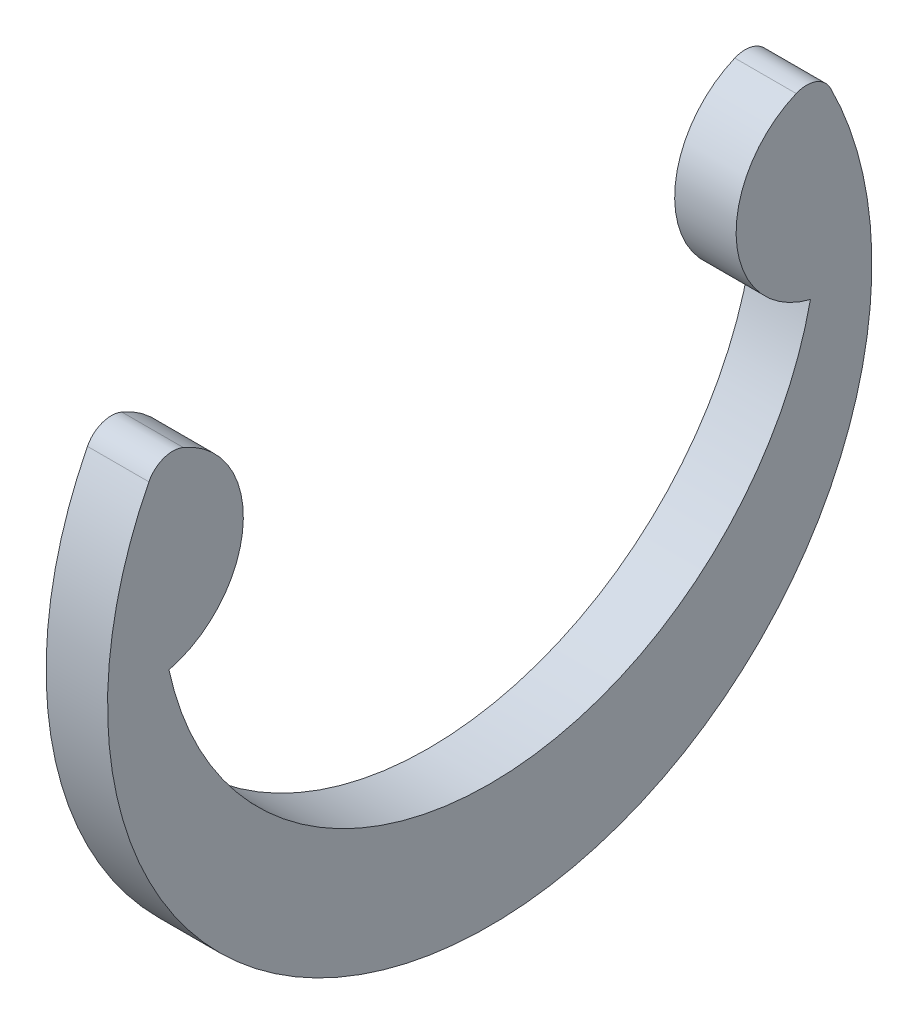
ISO-10303-21;
HEADER;
FILE_DESCRIPTION(('STEP AP214'),'2;1');
FILE_NAME('part.step','',(''),(''),'','','');
FILE_SCHEMA(('AUTOMOTIVE_DESIGN { 1 0 10303 214 1 1 1 1 }'));
ENDSEC;
DATA;
#1=APPLICATION_CONTEXT('core data for automotive mechanical design processes');
#2=APPLICATION_PROTOCOL_DEFINITION('international standard','automotive_design',2000,#1);
#3=PRODUCT_CONTEXT('',#1,'mechanical');
#4=PRODUCT('Part','Part','',(#3));
#5=PRODUCT_RELATED_PRODUCT_CATEGORY('part','',(#4));
#6=PRODUCT_DEFINITION_FORMATION('','',#4);
#7=PRODUCT_DEFINITION_CONTEXT('part definition',#1,'design');
#8=PRODUCT_DEFINITION('design','',#6,#7);
#9=PRODUCT_DEFINITION_SHAPE('','',#8);
#10=(LENGTH_UNIT() NAMED_UNIT(*) SI_UNIT(.MILLI.,.METRE.));
#11=(NAMED_UNIT(*) PLANE_ANGLE_UNIT() SI_UNIT($,.RADIAN.));
#12=(NAMED_UNIT(*) SI_UNIT($,.STERADIAN.) SOLID_ANGLE_UNIT());
#13=UNCERTAINTY_MEASURE_WITH_UNIT(LENGTH_MEASURE(1.E-05),#10,'distance_accuracy_value','');
#14=(GEOMETRIC_REPRESENTATION_CONTEXT(3) GLOBAL_UNCERTAINTY_ASSIGNED_CONTEXT((#13)) GLOBAL_UNIT_ASSIGNED_CONTEXT((#10,
#11,#12)) REPRESENTATION_CONTEXT('',''));
#15=CARTESIAN_POINT('',(0.,0.,0.));
#16=DIRECTION('',(0.,0.,1.));
#17=DIRECTION('',(1.,0.,0.));
#18=AXIS2_PLACEMENT_3D('',#15,#16,#17);
#19=CARTESIAN_POINT('',(-0.3175,0.846512328023186,1.77963484465552));
#20=DIRECTION('',(-1.,0.,0.));
#21=DIRECTION('',(0.,0.,1.));
#22=AXIS2_PLACEMENT_3D('',#19,#20,#21);
#23=PLANE('',#22);
#24=CARTESIAN_POINT('',(-0.3175,0.,0.));
#25=DIRECTION('',(-1.,0.,0.));
#26=DIRECTION('',(0.,0.,1.));
#27=AXIS2_PLACEMENT_3D('',#24,#25,#26);
#28=CIRCLE('',#27,3.9497);
#29=CARTESIAN_POINT('',(-0.3175,1.78646666666667,3.52259377999918));
#30=VERTEX_POINT('',#29);
#31=CARTESIAN_POINT('',(-0.3175,1.78646666666667,-3.52259377999918));
#32=VERTEX_POINT('',#31);
#33=EDGE_CURVE('E91',#30,#32,#28,.F.);
#34=ORIENTED_EDGE('',*,*,#33,.F.);
#35=CARTESIAN_POINT('',(-0.3175,1.66096845654136,3.27513368312914));
#36=DIRECTION('',(-1.,0.,0.));
#37=DIRECTION('',(0.,0.,1.));
#38=AXIS2_PLACEMENT_3D('',#35,#36,#37);
#39=CIRCLE('',#38,0.277464052243861);
#40=CARTESIAN_POINT('',(-0.3175,1.91687954310492,3.16791513967025));
#41=VERTEX_POINT('',#40);
#42=EDGE_CURVE('E81',#41,#30,#39,.F.);
#43=ORIENTED_EDGE('',*,*,#42,.F.);
#44=CARTESIAN_POINT('',(-0.3175,0.982787689221727,3.55926968931105));
#45=DIRECTION('',(-1.,0.,0.));
#46=DIRECTION('',(0.,0.,1.));
#47=AXIS2_PLACEMENT_3D('',#44,#45,#46);
#48=CIRCLE('',#47,1.01276155881603);
#49=CARTESIAN_POINT('',(-0.3175,0.,3.3147));
#50=VERTEX_POINT('',#49);
#51=EDGE_CURVE('E76',#50,#41,#48,.F.);
#52=ORIENTED_EDGE('',*,*,#51,.F.);
#53=CARTESIAN_POINT('',(-0.3175,0.710236966824645,0.));
#54=DIRECTION('',(-1.,0.,0.));
#55=DIRECTION('',(0.,0.,1.));
#56=AXIS2_PLACEMENT_3D('',#53,#54,#55);
#57=CIRCLE('',#56,3.38993696682464);
#58=CARTESIAN_POINT('',(-0.3175,0.,-3.3147));
#59=VERTEX_POINT('',#58);
#60=EDGE_CURVE('E20',#50,#59,#57,.F.);
#61=ORIENTED_EDGE('',*,*,#60,.T.);
#62=CARTESIAN_POINT('',(-0.3175,0.982787689221727,-3.55926968931105));
#63=DIRECTION('',(-1.,0.,0.));
#64=DIRECTION('',(0.,0.,1.));
#65=AXIS2_PLACEMENT_3D('',#62,#63,#64);
#66=CIRCLE('',#65,1.01276155881603);
#67=CARTESIAN_POINT('',(-0.3175,1.91687954310492,-3.16791513967025));
#68=VERTEX_POINT('',#67);
#69=EDGE_CURVE('E96',#68,#59,#66,.F.);
#70=ORIENTED_EDGE('',*,*,#69,.F.);
#71=CARTESIAN_POINT('',(-0.3175,1.66096845654136,-3.27513368312914));
#72=DIRECTION('',(-1.,0.,0.));
#73=DIRECTION('',(0.,0.,1.));
#74=AXIS2_PLACEMENT_3D('',#71,#72,#73);
#75=CIRCLE('',#74,0.277464052243861);
#76=EDGE_CURVE('E94',#32,#68,#75,.F.);
#77=ORIENTED_EDGE('',*,*,#76,.F.);
#78=EDGE_LOOP('',(#34,#43,#52,#61,#70,#77));
#79=FACE_BOUND('',#78,.T.);
#80=ADVANCED_FACE('F17',(#79),#23,.T.);
#81=CARTESIAN_POINT('',(0.3175,0.710236966824645,0.));
#82=DIRECTION('',(-1.,0.,0.));
#83=DIRECTION('',(0.,0.,1.));
#84=AXIS2_PLACEMENT_3D('',#81,#82,#83);
#85=CYLINDRICAL_SURFACE('',#84,3.38993696682464);
#86=DIRECTION('',(-1.,0.,0.));
#87=VECTOR('',#86,1.);
#88=CARTESIAN_POINT('',(0.3175,0.,3.3147));
#89=LINE('',#88,#87);
#90=CARTESIAN_POINT('',(0.3175,0.,3.3147));
#91=VERTEX_POINT('',#90);
#92=EDGE_CURVE('E70',#91,#50,#89,.T.);
#93=ORIENTED_EDGE('',*,*,#92,.F.);
#94=CARTESIAN_POINT('',(0.3175,0.710236966824645,0.));
#95=DIRECTION('',(-1.,0.,0.));
#96=DIRECTION('',(0.,0.,1.));
#97=AXIS2_PLACEMENT_3D('',#94,#95,#96);
#98=CIRCLE('',#97,3.38993696682464);
#99=CARTESIAN_POINT('',(0.3175,0.,-3.3147));
#100=VERTEX_POINT('',#99);
#101=EDGE_CURVE('E78',#91,#100,#98,.F.);
#102=ORIENTED_EDGE('',*,*,#101,.T.);
#103=DIRECTION('',(-1.,0.,0.));
#104=VECTOR('',#103,1.);
#105=CARTESIAN_POINT('',(0.3175,0.,-3.3147));
#106=LINE('',#105,#104);
#107=EDGE_CURVE('E71',#59,#100,#106,.F.);
#108=ORIENTED_EDGE('',*,*,#107,.F.);
#109=ORIENTED_EDGE('',*,*,#60,.F.);
#110=EDGE_LOOP('',(#93,#102,#108,#109));
#111=FACE_BOUND('',#110,.T.);
#112=ADVANCED_FACE('F68',(#111),#85,.F.);
#113=CARTESIAN_POINT('',(0.3175,0.982787689221727,-3.55926968931105));
#114=DIRECTION('',(-1.,0.,0.));
#115=DIRECTION('',(0.,0.,1.));
#116=AXIS2_PLACEMENT_3D('',#113,#114,#115);
#117=CYLINDRICAL_SURFACE('',#116,1.01276155881603);
#118=DIRECTION('',(-1.,0.,0.));
#119=VECTOR('',#118,1.);
#120=CARTESIAN_POINT('',(0.3175,1.91687954310492,-3.16791513967025));
#121=LINE('',#120,#119);
#122=CARTESIAN_POINT('',(0.3175,1.91687954310492,-3.16791513967025));
#123=VERTEX_POINT('',#122);
#124=EDGE_CURVE('E95',#68,#123,#121,.F.);
#125=ORIENTED_EDGE('',*,*,#124,.F.);
#126=ORIENTED_EDGE('',*,*,#69,.T.);
#127=ORIENTED_EDGE('',*,*,#107,.T.);
#128=CARTESIAN_POINT('',(0.3175,0.982787689221727,-3.55926968931105));
#129=DIRECTION('',(-1.,0.,0.));
#130=DIRECTION('',(0.,0.,1.));
#131=AXIS2_PLACEMENT_3D('',#128,#129,#130);
#132=CIRCLE('',#131,1.01276155881603);
#133=EDGE_CURVE('E111',#100,#123,#132,.T.);
#134=ORIENTED_EDGE('',*,*,#133,.T.);
#135=EDGE_LOOP('',(#125,#126,#127,#134));
#136=FACE_BOUND('',#135,.T.);
#137=ADVANCED_FACE('F168',(#136),#117,.T.);
#138=CARTESIAN_POINT('',(0.3175,1.66096845654136,-3.27513368312914));
#139=DIRECTION('',(-1.,0.,0.));
#140=DIRECTION('',(0.,0.,1.));
#141=AXIS2_PLACEMENT_3D('',#138,#139,#140);
#142=CYLINDRICAL_SURFACE('',#141,0.277464052243861);
#143=CARTESIAN_POINT('',(0.3175,1.66096845654136,-3.27513368312914));
#144=DIRECTION('',(-1.,0.,0.));
#145=DIRECTION('',(0.,0.,1.));
#146=AXIS2_PLACEMENT_3D('',#143,#144,#145);
#147=CIRCLE('',#146,0.277464052243861);
#148=CARTESIAN_POINT('',(0.3175,1.78646666666667,-3.52259377999918));
#149=VERTEX_POINT('',#148);
#150=EDGE_CURVE('E109',#123,#149,#147,.T.);
#151=ORIENTED_EDGE('',*,*,#150,.T.);
#152=DIRECTION('',(-1.,0.,0.));
#153=VECTOR('',#152,1.);
#154=CARTESIAN_POINT('',(0.3175,1.78646666666667,-3.52259377999918));
#155=LINE('',#154,#153);
#156=EDGE_CURVE('E93',#32,#149,#155,.F.);
#157=ORIENTED_EDGE('',*,*,#156,.F.);
#158=ORIENTED_EDGE('',*,*,#76,.T.);
#159=ORIENTED_EDGE('',*,*,#124,.T.);
#160=EDGE_LOOP('',(#151,#157,#158,#159));
#161=FACE_BOUND('',#160,.T.);
#162=ADVANCED_FACE('F120',(#161),#142,.T.);
#163=CARTESIAN_POINT('',(0.3175,0.,0.));
#164=DIRECTION('',(-1.,0.,0.));
#165=DIRECTION('',(0.,0.,1.));
#166=AXIS2_PLACEMENT_3D('',#163,#164,#165);
#167=CYLINDRICAL_SURFACE('',#166,3.9497);
#168=DIRECTION('',(-1.,0.,0.));
#169=VECTOR('',#168,1.);
#170=CARTESIAN_POINT('',(0.3175,1.78646666666667,3.52259377999918));
#171=LINE('',#170,#169);
#172=CARTESIAN_POINT('',(0.3175,1.78646666666667,3.52259377999918));
#173=VERTEX_POINT('',#172);
#174=EDGE_CURVE('E82',#30,#173,#171,.F.);
#175=ORIENTED_EDGE('',*,*,#174,.F.);
#176=ORIENTED_EDGE('',*,*,#33,.T.);
#177=ORIENTED_EDGE('',*,*,#156,.T.);
#178=CARTESIAN_POINT('',(0.3175,0.,0.));
#179=DIRECTION('',(-1.,0.,0.));
#180=DIRECTION('',(0.,0.,1.));
#181=AXIS2_PLACEMENT_3D('',#178,#179,#180);
#182=CIRCLE('',#181,3.9497);
#183=EDGE_CURVE('E107',#149,#173,#182,.T.);
#184=ORIENTED_EDGE('',*,*,#183,.T.);
#185=EDGE_LOOP('',(#175,#176,#177,#184));
#186=FACE_BOUND('',#185,.T.);
#187=ADVANCED_FACE('F124',(#186),#167,.T.);
#188=CARTESIAN_POINT('',(0.3175,1.66096845654136,3.27513368312914));
#189=DIRECTION('',(-1.,0.,0.));
#190=DIRECTION('',(0.,0.,1.));
#191=AXIS2_PLACEMENT_3D('',#188,#189,#190);
#192=CYLINDRICAL_SURFACE('',#191,0.277464052243861);
#193=CARTESIAN_POINT('',(0.3175,1.66096845654136,3.27513368312914));
#194=DIRECTION('',(-1.,0.,0.));
#195=DIRECTION('',(0.,0.,1.));
#196=AXIS2_PLACEMENT_3D('',#193,#194,#195);
#197=CIRCLE('',#196,0.277464052243861);
#198=CARTESIAN_POINT('',(0.3175,1.91687954310492,3.16791513967025));
#199=VERTEX_POINT('',#198);
#200=EDGE_CURVE('E26',#173,#199,#197,.T.);
#201=ORIENTED_EDGE('',*,*,#200,.T.);
#202=DIRECTION('',(-1.,0.,0.));
#203=VECTOR('',#202,1.);
#204=CARTESIAN_POINT('',(0.3175,1.91687954310492,3.16791513967025));
#205=LINE('',#204,#203);
#206=EDGE_CURVE('E34',#41,#199,#205,.F.);
#207=ORIENTED_EDGE('',*,*,#206,.F.);
#208=ORIENTED_EDGE('',*,*,#42,.T.);
#209=ORIENTED_EDGE('',*,*,#174,.T.);
#210=EDGE_LOOP('',(#201,#207,#208,#209));
#211=FACE_BOUND('',#210,.T.);
#212=ADVANCED_FACE('F126',(#211),#192,.T.);
#213=CARTESIAN_POINT('',(0.3175,0.982787689221727,3.55926968931105));
#214=DIRECTION('',(-1.,0.,0.));
#215=DIRECTION('',(0.,0.,1.));
#216=AXIS2_PLACEMENT_3D('',#213,#214,#215);
#217=CYLINDRICAL_SURFACE('',#216,1.01276155881603);
#218=CARTESIAN_POINT('',(0.3175,0.982787689221727,3.55926968931105));
#219=DIRECTION('',(-1.,0.,0.));
#220=DIRECTION('',(0.,0.,1.));
#221=AXIS2_PLACEMENT_3D('',#218,#219,#220);
#222=CIRCLE('',#221,1.01276155881603);
#223=EDGE_CURVE('E11',#199,#91,#222,.T.);
#224=ORIENTED_EDGE('',*,*,#223,.T.);
#225=ORIENTED_EDGE('',*,*,#92,.T.);
#226=ORIENTED_EDGE('',*,*,#51,.T.);
#227=ORIENTED_EDGE('',*,*,#206,.T.);
#228=EDGE_LOOP('',(#224,#225,#226,#227));
#229=FACE_BOUND('',#228,.T.);
#230=ADVANCED_FACE('F75',(#229),#217,.T.);
#231=CARTESIAN_POINT('',(0.3175,0.846512328023186,1.77963484465552));
#232=DIRECTION('',(-1.,0.,0.));
#233=DIRECTION('',(0.,0.,1.));
#234=AXIS2_PLACEMENT_3D('',#231,#232,#233);
#235=PLANE('',#234);
#236=ORIENTED_EDGE('',*,*,#200,.F.);
#237=ORIENTED_EDGE('',*,*,#183,.F.);
#238=ORIENTED_EDGE('',*,*,#150,.F.);
#239=ORIENTED_EDGE('',*,*,#133,.F.);
#240=ORIENTED_EDGE('',*,*,#101,.F.);
#241=ORIENTED_EDGE('',*,*,#223,.F.);
#242=EDGE_LOOP('',(#236,#237,#238,#239,#240,#241));
#243=FACE_BOUND('',#242,.T.);
#244=ADVANCED_FACE('F115',(#243),#235,.F.);
#245=CLOSED_SHELL('',(#80,#112,#137,#162,#187,#212,#230,#244));
#246=MANIFOLD_SOLID_BREP('B1',#245);
#247=ADVANCED_BREP_SHAPE_REPRESENTATION('',(#18,#246),#14);
#248=SHAPE_DEFINITION_REPRESENTATION(#9,#247);
ENDSEC;
END-ISO-10303-21;
